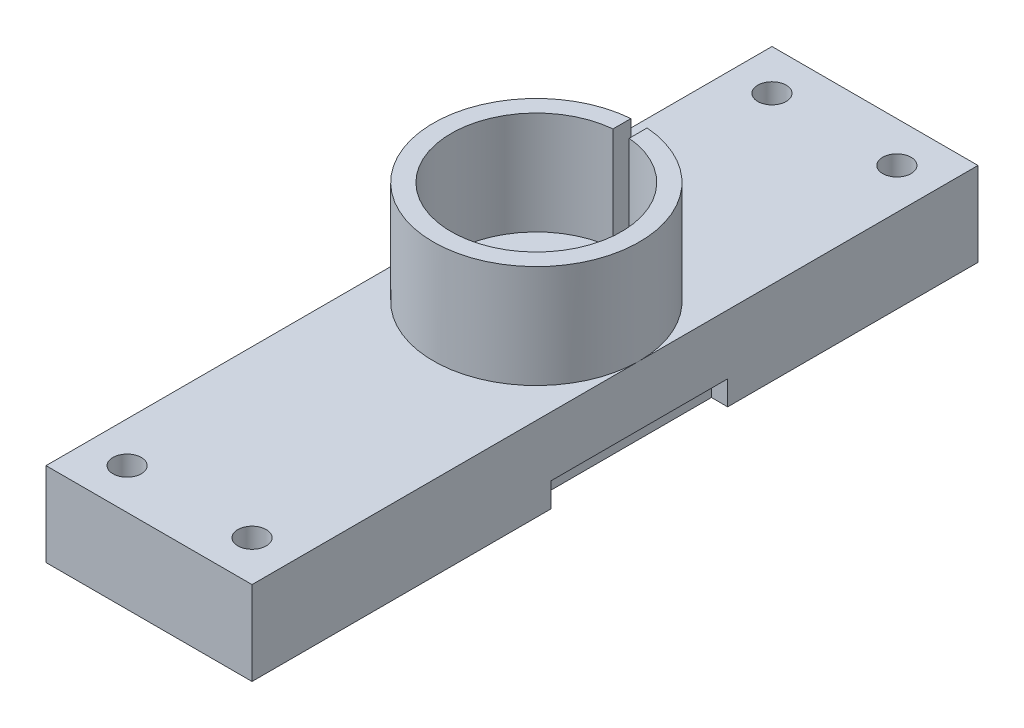
ISO-10303-21;
HEADER;
FILE_DESCRIPTION(('STEP AP214'),'2;1');
FILE_NAME('part.step','',(''),(''),'','','');
FILE_SCHEMA(('AUTOMOTIVE_DESIGN { 1 0 10303 214 1 1 1 1 }'));
ENDSEC;
DATA;
#1=APPLICATION_CONTEXT('core data for automotive mechanical design processes');
#2=APPLICATION_PROTOCOL_DEFINITION('international standard','automotive_design',2000,#1);
#3=PRODUCT_CONTEXT('',#1,'mechanical');
#4=PRODUCT('Part','Part','',(#3));
#5=PRODUCT_RELATED_PRODUCT_CATEGORY('part','',(#4));
#6=PRODUCT_DEFINITION_FORMATION('','',#4);
#7=PRODUCT_DEFINITION_CONTEXT('part definition',#1,'design');
#8=PRODUCT_DEFINITION('design','',#6,#7);
#9=PRODUCT_DEFINITION_SHAPE('','',#8);
#10=(LENGTH_UNIT() NAMED_UNIT(*) SI_UNIT(.MILLI.,.METRE.));
#11=(NAMED_UNIT(*) PLANE_ANGLE_UNIT() SI_UNIT($,.RADIAN.));
#12=(NAMED_UNIT(*) SI_UNIT($,.STERADIAN.) SOLID_ANGLE_UNIT());
#13=UNCERTAINTY_MEASURE_WITH_UNIT(LENGTH_MEASURE(1.E-05),#10,'distance_accuracy_value','');
#14=(GEOMETRIC_REPRESENTATION_CONTEXT(3) GLOBAL_UNCERTAINTY_ASSIGNED_CONTEXT((#13)) GLOBAL_UNIT_ASSIGNED_CONTEXT((#10,
#11,#12)) REPRESENTATION_CONTEXT('',''));
#15=CARTESIAN_POINT('',(0.,0.,0.));
#16=DIRECTION('',(0.,0.,1.));
#17=DIRECTION('',(1.,0.,0.));
#18=AXIS2_PLACEMENT_3D('',#15,#16,#17);
#19=CARTESIAN_POINT('',(0.,0.,0.));
#20=DIRECTION('',(0.,-1.,0.));
#21=DIRECTION('',(0.,0.,-1.));
#22=AXIS2_PLACEMENT_3D('',#19,#20,#21);
#23=PLANE('',#22);
#24=CARTESIAN_POINT('',(12.7,0.,-47.75000007));
#25=DIRECTION('',(0.,-1.,0.));
#26=DIRECTION('',(0.,0.,-1.));
#27=AXIS2_PLACEMENT_3D('',#24,#25,#26);
#28=CIRCLE('',#27,2.);
#29=CARTESIAN_POINT('',(12.7,0.,-49.75000007));
#30=VERTEX_POINT('',#29);
#31=EDGE_CURVE('E230',#30,#30,#28,.F.);
#32=ORIENTED_EDGE('',*,*,#31,.T.);
#33=EDGE_LOOP('',(#32));
#34=FACE_BOUND('',#33,.T.);
#35=CARTESIAN_POINT('',(5.,0.,-5.));
#36=DIRECTION('',(0.,1.,0.));
#37=DIRECTION('',(0.,0.,1.));
#38=AXIS2_PLACEMENT_3D('',#35,#36,#37);
#39=CIRCLE('',#38,1.75);
#40=CARTESIAN_POINT('',(5.,0.,-3.25));
#41=VERTEX_POINT('',#40);
#42=EDGE_CURVE('E273',#41,#41,#39,.T.);
#43=ORIENTED_EDGE('',*,*,#42,.T.);
#44=EDGE_LOOP('',(#43));
#45=FACE_BOUND('',#44,.T.);
#46=CARTESIAN_POINT('',(5.,0.,-84.50000007));
#47=DIRECTION('',(0.,1.,0.));
#48=DIRECTION('',(0.,0.,1.));
#49=AXIS2_PLACEMENT_3D('',#46,#47,#48);
#50=CIRCLE('',#49,1.75);
#51=CARTESIAN_POINT('',(5.,0.,-82.75000007));
#52=VERTEX_POINT('',#51);
#53=EDGE_CURVE('E285',#52,#52,#50,.T.);
#54=ORIENTED_EDGE('',*,*,#53,.T.);
#55=EDGE_LOOP('',(#54));
#56=FACE_BOUND('',#55,.T.);
#57=CARTESIAN_POINT('',(20.4,0.,-84.50000007));
#58=DIRECTION('',(0.,1.,0.));
#59=DIRECTION('',(0.,0.,1.));
#60=AXIS2_PLACEMENT_3D('',#57,#58,#59);
#61=CIRCLE('',#60,1.75);
#62=CARTESIAN_POINT('',(20.4,0.,-82.75000007));
#63=VERTEX_POINT('',#62);
#64=EDGE_CURVE('E279',#63,#63,#61,.T.);
#65=ORIENTED_EDGE('',*,*,#64,.T.);
#66=EDGE_LOOP('',(#65));
#67=FACE_BOUND('',#66,.T.);
#68=CARTESIAN_POINT('',(20.4,0.,-5.));
#69=DIRECTION('',(0.,1.,0.));
#70=DIRECTION('',(0.,0.,1.));
#71=AXIS2_PLACEMENT_3D('',#68,#69,#70);
#72=CIRCLE('',#71,1.75);
#73=CARTESIAN_POINT('',(20.4,0.,-3.25));
#74=VERTEX_POINT('',#73);
#75=EDGE_CURVE('E267',#74,#74,#72,.T.);
#76=ORIENTED_EDGE('',*,*,#75,.T.);
#77=EDGE_LOOP('',(#76));
#78=FACE_BOUND('',#77,.T.);
#79=DIRECTION('',(0.,0.,1.));
#80=VECTOR('',#79,1.);
#81=CARTESIAN_POINT('',(0.,0.,0.));
#82=LINE('',#81,#80);
#83=CARTESIAN_POINT('',(0.,0.,-36.86));
#84=VERTEX_POINT('',#83);
#85=CARTESIAN_POINT('',(0.,0.,0.));
#86=VERTEX_POINT('',#85);
#87=EDGE_CURVE('E291',#84,#86,#82,.T.);
#88=ORIENTED_EDGE('',*,*,#87,.F.);
#89=DIRECTION('',(-1.,0.,0.));
#90=VECTOR('',#89,1.);
#91=CARTESIAN_POINT('',(2.,0.,-36.86));
#92=LINE('',#91,#90);
#93=CARTESIAN_POINT('',(2.,0.,-36.86));
#94=VERTEX_POINT('',#93);
#95=EDGE_CURVE('E194',#94,#84,#92,.T.);
#96=ORIENTED_EDGE('',*,*,#95,.F.);
#97=DIRECTION('',(0.,0.,-1.));
#98=VECTOR('',#97,1.);
#99=CARTESIAN_POINT('',(2.,0.,-36.86));
#100=LINE('',#99,#98);
#101=CARTESIAN_POINT('',(2.,0.,-58.64000007));
#102=VERTEX_POINT('',#101);
#103=EDGE_CURVE('E180',#94,#102,#100,.T.);
#104=ORIENTED_EDGE('',*,*,#103,.T.);
#105=DIRECTION('',(-1.,0.,0.));
#106=VECTOR('',#105,1.);
#107=CARTESIAN_POINT('',(2.,0.,-58.64000007));
#108=LINE('',#107,#106);
#109=CARTESIAN_POINT('',(0.,0.,-58.64000007));
#110=VERTEX_POINT('',#109);
#111=EDGE_CURVE('E197',#102,#110,#108,.T.);
#112=ORIENTED_EDGE('',*,*,#111,.T.);
#113=CARTESIAN_POINT('',(0.,0.,-89.50000007));
#114=VERTEX_POINT('',#113);
#115=EDGE_CURVE('E306',#114,#110,#82,.T.);
#116=ORIENTED_EDGE('',*,*,#115,.F.);
#117=DIRECTION('',(-1.,0.,0.));
#118=VECTOR('',#117,1.);
#119=CARTESIAN_POINT('',(0.,0.,-89.50000007));
#120=LINE('',#119,#118);
#121=CARTESIAN_POINT('',(25.4,0.,-89.50000007));
#122=VERTEX_POINT('',#121);
#123=EDGE_CURVE('E315',#122,#114,#120,.T.);
#124=ORIENTED_EDGE('',*,*,#123,.F.);
#125=DIRECTION('',(0.,0.,-1.));
#126=VECTOR('',#125,1.);
#127=CARTESIAN_POINT('',(25.4,0.,0.));
#128=LINE('',#127,#126);
#129=CARTESIAN_POINT('',(25.4,0.,-58.64000007));
#130=VERTEX_POINT('',#129);
#131=EDGE_CURVE('E311',#130,#122,#128,.T.);
#132=ORIENTED_EDGE('',*,*,#131,.F.);
#133=DIRECTION('',(1.,0.,0.));
#134=VECTOR('',#133,1.);
#135=CARTESIAN_POINT('',(23.4,0.,-58.64000007));
#136=LINE('',#135,#134);
#137=CARTESIAN_POINT('',(23.4,0.,-58.64000007));
#138=VERTEX_POINT('',#137);
#139=EDGE_CURVE('E67',#138,#130,#136,.T.);
#140=ORIENTED_EDGE('',*,*,#139,.F.);
#141=DIRECTION('',(0.,0.,-1.));
#142=VECTOR('',#141,1.);
#143=CARTESIAN_POINT('',(23.4,0.,-36.86));
#144=LINE('',#143,#142);
#145=CARTESIAN_POINT('',(23.4,0.,-36.86));
#146=VERTEX_POINT('',#145);
#147=EDGE_CURVE('E204',#146,#138,#144,.T.);
#148=ORIENTED_EDGE('',*,*,#147,.F.);
#149=DIRECTION('',(1.,0.,0.));
#150=VECTOR('',#149,1.);
#151=CARTESIAN_POINT('',(23.4,0.,-36.86));
#152=LINE('',#151,#150);
#153=CARTESIAN_POINT('',(25.4,0.,-36.86));
#154=VERTEX_POINT('',#153);
#155=EDGE_CURVE('E214',#146,#154,#152,.T.);
#156=ORIENTED_EDGE('',*,*,#155,.T.);
#157=CARTESIAN_POINT('',(25.4,0.,0.));
#158=VERTEX_POINT('',#157);
#159=EDGE_CURVE('E312',#158,#154,#128,.T.);
#160=ORIENTED_EDGE('',*,*,#159,.F.);
#161=DIRECTION('',(1.,0.,0.));
#162=VECTOR('',#161,1.);
#163=CARTESIAN_POINT('',(0.,0.,0.));
#164=LINE('',#163,#162);
#165=EDGE_CURVE('E309',#86,#158,#164,.T.);
#166=ORIENTED_EDGE('',*,*,#165,.F.);
#167=EDGE_LOOP('',(#88,#96,#104,#112,#116,#124,#132,#140,#148,#156,#160,#166));
#168=FACE_BOUND('',#167,.T.);
#169=ADVANCED_FACE('F41',(#34,#45,#56,#67,#78,#168),#23,.T.);
#170=CARTESIAN_POINT('',(0.,10.35,0.));
#171=DIRECTION('',(1.,0.,0.));
#172=DIRECTION('',(0.,0.,-1.));
#173=AXIS2_PLACEMENT_3D('',#170,#171,#172);
#174=PLANE('',#173);
#175=DIRECTION('',(0.,-1.,0.));
#176=VECTOR('',#175,1.);
#177=CARTESIAN_POINT('',(0.,0.,-36.86));
#178=LINE('',#177,#176);
#179=CARTESIAN_POINT('',(0.,3.,-36.86));
#180=VERTEX_POINT('',#179);
#181=EDGE_CURVE('E59',#180,#84,#178,.T.);
#182=ORIENTED_EDGE('',*,*,#181,.T.);
#183=ORIENTED_EDGE('',*,*,#87,.T.);
#184=DIRECTION('',(0.,-1.,0.));
#185=VECTOR('',#184,1.);
#186=CARTESIAN_POINT('',(0.,10.35,0.));
#187=LINE('',#186,#185);
#188=CARTESIAN_POINT('',(0.,10.35,0.));
#189=VERTEX_POINT('',#188);
#190=EDGE_CURVE('E45',#189,#86,#187,.T.);
#191=ORIENTED_EDGE('',*,*,#190,.F.);
#192=DIRECTION('',(0.,0.,1.));
#193=VECTOR('',#192,1.);
#194=CARTESIAN_POINT('',(0.,10.35,0.));
#195=LINE('',#194,#193);
#196=CARTESIAN_POINT('',(0.,10.35,-47.75000007));
#197=VERTEX_POINT('',#196);
#198=EDGE_CURVE('E298',#197,#189,#195,.T.);
#199=ORIENTED_EDGE('',*,*,#198,.F.);
#200=CARTESIAN_POINT('',(0.,10.35,-89.50000007));
#201=VERTEX_POINT('',#200);
#202=EDGE_CURVE('E294',#201,#197,#195,.T.);
#203=ORIENTED_EDGE('',*,*,#202,.F.);
#204=DIRECTION('',(0.,-1.,0.));
#205=VECTOR('',#204,1.);
#206=CARTESIAN_POINT('',(0.,10.35,-89.50000007));
#207=LINE('',#206,#205);
#208=EDGE_CURVE('E305',#201,#114,#207,.T.);
#209=ORIENTED_EDGE('',*,*,#208,.T.);
#210=ORIENTED_EDGE('',*,*,#115,.T.);
#211=DIRECTION('',(0.,1.,0.));
#212=VECTOR('',#211,1.);
#213=CARTESIAN_POINT('',(0.,0.,-58.64000007));
#214=LINE('',#213,#212);
#215=CARTESIAN_POINT('',(0.,3.,-58.64000007));
#216=VERTEX_POINT('',#215);
#217=EDGE_CURVE('E184',#110,#216,#214,.T.);
#218=ORIENTED_EDGE('',*,*,#217,.T.);
#219=DIRECTION('',(0.,0.,1.));
#220=VECTOR('',#219,1.);
#221=CARTESIAN_POINT('',(0.,3.,-36.86));
#222=LINE('',#221,#220);
#223=EDGE_CURVE('E187',#216,#180,#222,.T.);
#224=ORIENTED_EDGE('',*,*,#223,.T.);
#225=EDGE_LOOP('',(#182,#183,#191,#199,#203,#209,#210,#218,#224));
#226=FACE_BOUND('',#225,.T.);
#227=ADVANCED_FACE('F43',(#226),#174,.F.);
#228=CARTESIAN_POINT('',(0.,10.35,0.));
#229=DIRECTION('',(0.,-1.,0.));
#230=DIRECTION('',(0.,0.,-1.));
#231=AXIS2_PLACEMENT_3D('',#228,#229,#230);
#232=PLANE('',#231);
#233=CARTESIAN_POINT('',(12.7,10.35,-47.75000007));
#234=DIRECTION('',(0.,1.,0.));
#235=DIRECTION('',(0.,0.,1.));
#236=AXIS2_PLACEMENT_3D('',#233,#234,#235);
#237=CIRCLE('',#236,12.7);
#238=CARTESIAN_POINT('',(25.4,10.35,-47.75000007));
#239=VERTEX_POINT('',#238);
#240=EDGE_CURVE('E11',#197,#239,#237,.T.);
#241=ORIENTED_EDGE('',*,*,#240,.F.);
#242=ORIENTED_EDGE('',*,*,#198,.T.);
#243=DIRECTION('',(1.,0.,0.));
#244=VECTOR('',#243,1.);
#245=CARTESIAN_POINT('',(0.,10.35,0.));
#246=LINE('',#245,#244);
#247=CARTESIAN_POINT('',(25.4,10.35,0.));
#248=VERTEX_POINT('',#247);
#249=EDGE_CURVE('E297',#189,#248,#246,.T.);
#250=ORIENTED_EDGE('',*,*,#249,.T.);
#251=DIRECTION('',(0.,0.,-1.));
#252=VECTOR('',#251,1.);
#253=CARTESIAN_POINT('',(25.4,10.35,0.));
#254=LINE('',#253,#252);
#255=EDGE_CURVE('E301',#248,#239,#254,.T.);
#256=ORIENTED_EDGE('',*,*,#255,.T.);
#257=EDGE_LOOP('',(#241,#242,#250,#256));
#258=FACE_BOUND('',#257,.T.);
#259=CARTESIAN_POINT('',(5.,10.35,-5.));
#260=DIRECTION('',(0.,1.,0.));
#261=DIRECTION('',(0.,0.,1.));
#262=AXIS2_PLACEMENT_3D('',#259,#260,#261);
#263=CIRCLE('',#262,1.75);
#264=CARTESIAN_POINT('',(5.,10.35,-3.25));
#265=VERTEX_POINT('',#264);
#266=EDGE_CURVE('E276',#265,#265,#263,.T.);
#267=ORIENTED_EDGE('',*,*,#266,.F.);
#268=EDGE_LOOP('',(#267));
#269=FACE_BOUND('',#268,.T.);
#270=CARTESIAN_POINT('',(20.4,10.35,-5.));
#271=DIRECTION('',(0.,1.,0.));
#272=DIRECTION('',(0.,0.,1.));
#273=AXIS2_PLACEMENT_3D('',#270,#271,#272);
#274=CIRCLE('',#273,1.75);
#275=CARTESIAN_POINT('',(20.4,10.35,-3.25));
#276=VERTEX_POINT('',#275);
#277=EDGE_CURVE('E270',#276,#276,#274,.T.);
#278=ORIENTED_EDGE('',*,*,#277,.F.);
#279=EDGE_LOOP('',(#278));
#280=FACE_BOUND('',#279,.T.);
#281=ADVANCED_FACE('F365',(#258,#269,#280),#232,.F.);
#282=CARTESIAN_POINT('',(0.,10.35,0.));
#283=DIRECTION('',(0.,0.,-1.));
#284=DIRECTION('',(-1.,0.,0.));
#285=AXIS2_PLACEMENT_3D('',#282,#283,#284);
#286=PLANE('',#285);
#287=ORIENTED_EDGE('',*,*,#165,.T.);
#288=DIRECTION('',(0.,-1.,0.));
#289=VECTOR('',#288,1.);
#290=CARTESIAN_POINT('',(25.4,10.35,0.));
#291=LINE('',#290,#289);
#292=EDGE_CURVE('E321',#248,#158,#291,.T.);
#293=ORIENTED_EDGE('',*,*,#292,.F.);
#294=ORIENTED_EDGE('',*,*,#249,.F.);
#295=ORIENTED_EDGE('',*,*,#190,.T.);
#296=EDGE_LOOP('',(#287,#293,#294,#295));
#297=FACE_BOUND('',#296,.T.);
#298=ADVANCED_FACE('F331',(#297),#286,.F.);
#299=CARTESIAN_POINT('',(25.4,10.35,0.));
#300=DIRECTION('',(-1.,0.,0.));
#301=DIRECTION('',(0.,0.,1.));
#302=AXIS2_PLACEMENT_3D('',#299,#300,#301);
#303=PLANE('',#302);
#304=ORIENTED_EDGE('',*,*,#159,.T.);
#305=DIRECTION('',(0.,-1.,0.));
#306=VECTOR('',#305,1.);
#307=CARTESIAN_POINT('',(25.4,0.,-36.86));
#308=LINE('',#307,#306);
#309=CARTESIAN_POINT('',(25.4,3.,-36.86));
#310=VERTEX_POINT('',#309);
#311=EDGE_CURVE('E196',#310,#154,#308,.T.);
#312=ORIENTED_EDGE('',*,*,#311,.F.);
#313=DIRECTION('',(0.,0.,1.));
#314=VECTOR('',#313,1.);
#315=CARTESIAN_POINT('',(25.4,3.,-36.86));
#316=LINE('',#315,#314);
#317=CARTESIAN_POINT('',(25.4,3.,-58.64000007));
#318=VERTEX_POINT('',#317);
#319=EDGE_CURVE('E205',#318,#310,#316,.T.);
#320=ORIENTED_EDGE('',*,*,#319,.F.);
#321=DIRECTION('',(0.,1.,0.));
#322=VECTOR('',#321,1.);
#323=CARTESIAN_POINT('',(25.4,0.,-58.64000007));
#324=LINE('',#323,#322);
#325=EDGE_CURVE('E216',#130,#318,#324,.T.);
#326=ORIENTED_EDGE('',*,*,#325,.F.);
#327=ORIENTED_EDGE('',*,*,#131,.T.);
#328=DIRECTION('',(0.,-1.,0.));
#329=VECTOR('',#328,1.);
#330=CARTESIAN_POINT('',(25.4,10.35,-89.50000007));
#331=LINE('',#330,#329);
#332=CARTESIAN_POINT('',(25.4,10.35,-89.50000007));
#333=VERTEX_POINT('',#332);
#334=EDGE_CURVE('E319',#333,#122,#331,.T.);
#335=ORIENTED_EDGE('',*,*,#334,.F.);
#336=EDGE_CURVE('E300',#239,#333,#254,.T.);
#337=ORIENTED_EDGE('',*,*,#336,.F.);
#338=ORIENTED_EDGE('',*,*,#255,.F.);
#339=ORIENTED_EDGE('',*,*,#292,.T.);
#340=EDGE_LOOP('',(#304,#312,#320,#326,#327,#335,#337,#338,#339));
#341=FACE_BOUND('',#340,.T.);
#342=ADVANCED_FACE('F340',(#341),#303,.F.);
#343=CARTESIAN_POINT('',(0.,10.35,-89.50000007));
#344=DIRECTION('',(0.,0.,1.));
#345=DIRECTION('',(1.,0.,0.));
#346=AXIS2_PLACEMENT_3D('',#343,#344,#345);
#347=PLANE('',#346);
#348=ORIENTED_EDGE('',*,*,#123,.T.);
#349=ORIENTED_EDGE('',*,*,#208,.F.);
#350=DIRECTION('',(-1.,0.,0.));
#351=VECTOR('',#350,1.);
#352=CARTESIAN_POINT('',(0.,10.35,-89.50000007));
#353=LINE('',#352,#351);
#354=EDGE_CURVE('E303',#333,#201,#353,.T.);
#355=ORIENTED_EDGE('',*,*,#354,.F.);
#356=ORIENTED_EDGE('',*,*,#334,.T.);
#357=EDGE_LOOP('',(#348,#349,#355,#356));
#358=FACE_BOUND('',#357,.T.);
#359=ADVANCED_FACE('F355',(#358),#347,.F.);
#360=CARTESIAN_POINT('',(5.,10.35,-84.50000007));
#361=DIRECTION('',(0.,-1.,0.));
#362=DIRECTION('',(0.,0.,-1.));
#363=AXIS2_PLACEMENT_3D('',#360,#361,#362);
#364=CYLINDRICAL_SURFACE('',#363,1.75);
#365=CARTESIAN_POINT('',(5.,10.35,-84.50000007));
#366=DIRECTION('',(0.,1.,0.));
#367=DIRECTION('',(0.,0.,1.));
#368=AXIS2_PLACEMENT_3D('',#365,#366,#367);
#369=CIRCLE('',#368,1.75);
#370=CARTESIAN_POINT('',(5.,10.35,-82.75000007));
#371=VERTEX_POINT('',#370);
#372=EDGE_CURVE('E288',#371,#371,#369,.T.);
#373=ORIENTED_EDGE('',*,*,#372,.T.);
#374=EDGE_LOOP('',(#373));
#375=FACE_BOUND('',#374,.T.);
#376=ORIENTED_EDGE('',*,*,#53,.F.);
#377=EDGE_LOOP('',(#376));
#378=FACE_BOUND('',#377,.T.);
#379=ADVANCED_FACE('F406',(#375,#378),#364,.F.);
#380=CARTESIAN_POINT('',(20.4,10.35,-84.50000007));
#381=DIRECTION('',(0.,-1.,0.));
#382=DIRECTION('',(0.,0.,-1.));
#383=AXIS2_PLACEMENT_3D('',#380,#381,#382);
#384=CYLINDRICAL_SURFACE('',#383,1.75);
#385=CARTESIAN_POINT('',(20.4,10.35,-84.50000007));
#386=DIRECTION('',(0.,1.,0.));
#387=DIRECTION('',(0.,0.,1.));
#388=AXIS2_PLACEMENT_3D('',#385,#386,#387);
#389=CIRCLE('',#388,1.75);
#390=CARTESIAN_POINT('',(20.4,10.35,-82.75000007));
#391=VERTEX_POINT('',#390);
#392=EDGE_CURVE('E282',#391,#391,#389,.T.);
#393=ORIENTED_EDGE('',*,*,#392,.T.);
#394=EDGE_LOOP('',(#393));
#395=FACE_BOUND('',#394,.T.);
#396=ORIENTED_EDGE('',*,*,#64,.F.);
#397=EDGE_LOOP('',(#396));
#398=FACE_BOUND('',#397,.T.);
#399=ADVANCED_FACE('F611',(#395,#398),#384,.F.);
#400=CARTESIAN_POINT('',(5.,10.35,-5.));
#401=DIRECTION('',(0.,-1.,0.));
#402=DIRECTION('',(0.,0.,-1.));
#403=AXIS2_PLACEMENT_3D('',#400,#401,#402);
#404=CYLINDRICAL_SURFACE('',#403,1.75);
#405=ORIENTED_EDGE('',*,*,#266,.T.);
#406=EDGE_LOOP('',(#405));
#407=FACE_BOUND('',#406,.T.);
#408=ORIENTED_EDGE('',*,*,#42,.F.);
#409=EDGE_LOOP('',(#408));
#410=FACE_BOUND('',#409,.T.);
#411=ADVANCED_FACE('F600',(#407,#410),#404,.F.);
#412=CARTESIAN_POINT('',(20.4,10.35,-5.));
#413=DIRECTION('',(0.,-1.,0.));
#414=DIRECTION('',(0.,0.,-1.));
#415=AXIS2_PLACEMENT_3D('',#412,#413,#414);
#416=CYLINDRICAL_SURFACE('',#415,1.75);
#417=ORIENTED_EDGE('',*,*,#277,.T.);
#418=EDGE_LOOP('',(#417));
#419=FACE_BOUND('',#418,.T.);
#420=ORIENTED_EDGE('',*,*,#75,.F.);
#421=EDGE_LOOP('',(#420));
#422=FACE_BOUND('',#421,.T.);
#423=ADVANCED_FACE('F589',(#419,#422),#416,.F.);
#424=CARTESIAN_POINT('',(12.7,23.05,-47.75000007));
#425=DIRECTION('',(0.,1.,0.));
#426=DIRECTION('',(0.,0.,1.));
#427=AXIS2_PLACEMENT_3D('',#424,#425,#426);
#428=PLANE('',#427);
#429=DIRECTION('',(0.,0.,-1.));
#430=VECTOR('',#429,1.);
#431=CARTESIAN_POINT('',(13.7,23.05,-62.7042575224812));
#432=LINE('',#431,#430);
#433=CARTESIAN_POINT('',(13.7,23.05,-58.2022725501834));
#434=VERTEX_POINT('',#433);
#435=CARTESIAN_POINT('',(13.7,23.05,-60.4105687776055));
#436=VERTEX_POINT('',#435);
#437=EDGE_CURVE('E240',#434,#436,#432,.T.);
#438=ORIENTED_EDGE('',*,*,#437,.F.);
#439=CARTESIAN_POINT('',(12.7,23.05,-47.75000007));
#440=DIRECTION('',(0.,1.,0.));
#441=DIRECTION('',(0.,0.,1.));
#442=AXIS2_PLACEMENT_3D('',#439,#440,#441);
#443=CIRCLE('',#442,10.5);
#444=CARTESIAN_POINT('',(11.7,23.05,-58.2022725501834));
#445=VERTEX_POINT('',#444);
#446=EDGE_CURVE('E260',#445,#434,#443,.T.);
#447=ORIENTED_EDGE('',*,*,#446,.F.);
#448=DIRECTION('',(0.,0.,1.));
#449=VECTOR('',#448,1.);
#450=CARTESIAN_POINT('',(11.7,23.05,-62.7042575224812));
#451=LINE('',#450,#449);
#452=CARTESIAN_POINT('',(11.7,23.05,-60.4105687776055));
#453=VERTEX_POINT('',#452);
#454=EDGE_CURVE('E237',#453,#445,#451,.T.);
#455=ORIENTED_EDGE('',*,*,#454,.F.);
#456=CARTESIAN_POINT('',(12.7,23.05,-47.75000007));
#457=DIRECTION('',(0.,1.,0.));
#458=DIRECTION('',(0.,0.,1.));
#459=AXIS2_PLACEMENT_3D('',#456,#457,#458);
#460=CIRCLE('',#459,12.7);
#461=EDGE_CURVE('E265',#453,#436,#460,.T.);
#462=ORIENTED_EDGE('',*,*,#461,.T.);
#463=EDGE_LOOP('',(#438,#447,#455,#462));
#464=FACE_BOUND('',#463,.T.);
#465=ADVANCED_FACE('F377',(#464),#428,.T.);
#466=CARTESIAN_POINT('',(12.7,23.05,-47.75000007));
#467=DIRECTION('',(0.,-1.,0.));
#468=DIRECTION('',(0.,0.,-1.));
#469=AXIS2_PLACEMENT_3D('',#466,#467,#468);
#470=CYLINDRICAL_SURFACE('',#469,12.7);
#471=CARTESIAN_POINT('',(13.7,10.35,-60.4105687776055));
#472=VERTEX_POINT('',#471);
#473=EDGE_CURVE('E51',#239,#472,#237,.T.);
#474=ORIENTED_EDGE('',*,*,#473,.T.);
#475=DIRECTION('',(0.,-1.,0.));
#476=VECTOR('',#475,1.);
#477=CARTESIAN_POINT('',(13.7,23.05,-60.4105687776055));
#478=LINE('',#477,#476);
#479=EDGE_CURVE('E256',#472,#436,#478,.F.);
#480=ORIENTED_EDGE('',*,*,#479,.T.);
#481=ORIENTED_EDGE('',*,*,#461,.F.);
#482=DIRECTION('',(0.,-1.,0.));
#483=VECTOR('',#482,1.);
#484=CARTESIAN_POINT('',(11.7,23.05,-60.4105687776055));
#485=LINE('',#484,#483);
#486=CARTESIAN_POINT('',(11.7,10.35,-60.4105687776055));
#487=VERTEX_POINT('',#486);
#488=EDGE_CURVE('E251',#453,#487,#485,.T.);
#489=ORIENTED_EDGE('',*,*,#488,.T.);
#490=EDGE_CURVE('E52',#487,#197,#237,.T.);
#491=ORIENTED_EDGE('',*,*,#490,.T.);
#492=ORIENTED_EDGE('',*,*,#240,.T.);
#493=EDGE_LOOP('',(#474,#480,#481,#489,#491,#492));
#494=FACE_BOUND('',#493,.T.);
#495=ADVANCED_FACE('F368',(#494),#470,.T.);
#496=CARTESIAN_POINT('',(12.7,23.05,-47.75000007));
#497=DIRECTION('',(0.,-1.,0.));
#498=DIRECTION('',(0.,0.,-1.));
#499=AXIS2_PLACEMENT_3D('',#496,#497,#498);
#500=CYLINDRICAL_SURFACE('',#499,10.5);
#501=DIRECTION('',(0.,-1.,0.));
#502=VECTOR('',#501,1.);
#503=CARTESIAN_POINT('',(13.7,23.05,-58.2022725501834));
#504=LINE('',#503,#502);
#505=CARTESIAN_POINT('',(13.7,10.35,-58.2022725501834));
#506=VERTEX_POINT('',#505);
#507=EDGE_CURVE('E254',#506,#434,#504,.F.);
#508=ORIENTED_EDGE('',*,*,#507,.F.);
#509=CARTESIAN_POINT('',(12.7,10.35,-47.75000007));
#510=DIRECTION('',(0.,1.,0.));
#511=DIRECTION('',(0.,0.,1.));
#512=AXIS2_PLACEMENT_3D('',#509,#510,#511);
#513=CIRCLE('',#512,10.5);
#514=CARTESIAN_POINT('',(11.7,10.35,-58.2022725501834));
#515=VERTEX_POINT('',#514);
#516=EDGE_CURVE('E259',#515,#506,#513,.T.);
#517=ORIENTED_EDGE('',*,*,#516,.F.);
#518=DIRECTION('',(0.,-1.,0.));
#519=VECTOR('',#518,1.);
#520=CARTESIAN_POINT('',(11.7,23.05,-58.2022725501834));
#521=LINE('',#520,#519);
#522=EDGE_CURVE('E247',#445,#515,#521,.T.);
#523=ORIENTED_EDGE('',*,*,#522,.F.);
#524=ORIENTED_EDGE('',*,*,#446,.T.);
#525=EDGE_LOOP('',(#508,#517,#523,#524));
#526=FACE_BOUND('',#525,.T.);
#527=ADVANCED_FACE('F380',(#526),#500,.F.);
#528=CARTESIAN_POINT('',(12.7,10.35,-47.75000007));
#529=DIRECTION('',(0.,1.,0.));
#530=DIRECTION('',(0.,0.,1.));
#531=AXIS2_PLACEMENT_3D('',#528,#529,#530);
#532=CIRCLE('',#531,6.);
#533=CARTESIAN_POINT('',(12.7,10.35,-41.75000007));
#534=VERTEX_POINT('',#533);
#535=EDGE_CURVE('E233',#534,#534,#532,.T.);
#536=ORIENTED_EDGE('',*,*,#535,.F.);
#537=EDGE_LOOP('',(#536));
#538=FACE_BOUND('',#537,.T.);
#539=DIRECTION('',(0.,0.,-1.));
#540=VECTOR('',#539,1.);
#541=CARTESIAN_POINT('',(13.7,10.35,-62.7042575224812));
#542=LINE('',#541,#540);
#543=EDGE_CURVE('E242',#506,#472,#542,.T.);
#544=ORIENTED_EDGE('',*,*,#543,.T.);
#545=ORIENTED_EDGE('',*,*,#473,.F.);
#546=ORIENTED_EDGE('',*,*,#336,.T.);
#547=ORIENTED_EDGE('',*,*,#354,.T.);
#548=ORIENTED_EDGE('',*,*,#202,.T.);
#549=ORIENTED_EDGE('',*,*,#490,.F.);
#550=DIRECTION('',(0.,0.,1.));
#551=VECTOR('',#550,1.);
#552=CARTESIAN_POINT('',(11.7,10.35,-62.7042575224812));
#553=LINE('',#552,#551);
#554=EDGE_CURVE('E244',#487,#515,#553,.T.);
#555=ORIENTED_EDGE('',*,*,#554,.T.);
#556=ORIENTED_EDGE('',*,*,#516,.T.);
#557=EDGE_LOOP('',(#544,#545,#546,#547,#548,#549,#555,#556));
#558=FACE_BOUND('',#557,.T.);
#559=ORIENTED_EDGE('',*,*,#392,.F.);
#560=EDGE_LOOP('',(#559));
#561=FACE_BOUND('',#560,.T.);
#562=ORIENTED_EDGE('',*,*,#372,.F.);
#563=EDGE_LOOP('',(#562));
#564=FACE_BOUND('',#563,.T.);
#565=ADVANCED_FACE('F359',(#538,#558,#561,#564),#232,.F.);
#566=CARTESIAN_POINT('',(13.7,2.09653797374914,-62.7042575224812));
#567=DIRECTION('',(1.,0.,0.));
#568=DIRECTION('',(0.,0.,-1.));
#569=AXIS2_PLACEMENT_3D('',#566,#567,#568);
#570=PLANE('',#569);
#571=ORIENTED_EDGE('',*,*,#543,.F.);
#572=ORIENTED_EDGE('',*,*,#507,.T.);
#573=ORIENTED_EDGE('',*,*,#437,.T.);
#574=ORIENTED_EDGE('',*,*,#479,.F.);
#575=EDGE_LOOP('',(#571,#572,#573,#574));
#576=FACE_BOUND('',#575,.T.);
#577=ADVANCED_FACE('F383',(#576),#570,.F.);
#578=CARTESIAN_POINT('',(11.7,2.09653797374914,-62.7042575224812));
#579=DIRECTION('',(-1.,0.,0.));
#580=DIRECTION('',(0.,0.,1.));
#581=AXIS2_PLACEMENT_3D('',#578,#579,#580);
#582=PLANE('',#581);
#583=ORIENTED_EDGE('',*,*,#454,.T.);
#584=ORIENTED_EDGE('',*,*,#522,.T.);
#585=ORIENTED_EDGE('',*,*,#554,.F.);
#586=ORIENTED_EDGE('',*,*,#488,.F.);
#587=EDGE_LOOP('',(#583,#584,#585,#586));
#588=FACE_BOUND('',#587,.T.);
#589=ADVANCED_FACE('F372',(#588),#582,.F.);
#590=CARTESIAN_POINT('',(12.7,7.35,-47.75000007));
#591=DIRECTION('',(0.,1.,0.));
#592=DIRECTION('',(0.,0.,1.));
#593=AXIS2_PLACEMENT_3D('',#590,#591,#592);
#594=CYLINDRICAL_SURFACE('',#593,6.);
#595=CARTESIAN_POINT('',(12.7,7.35,-47.75000007));
#596=DIRECTION('',(0.,1.,0.));
#597=DIRECTION('',(0.,0.,1.));
#598=AXIS2_PLACEMENT_3D('',#595,#596,#597);
#599=CIRCLE('',#598,6.);
#600=CARTESIAN_POINT('',(12.7,7.35,-41.75000007));
#601=VERTEX_POINT('',#600);
#602=EDGE_CURVE('E234',#601,#601,#599,.T.);
#603=ORIENTED_EDGE('',*,*,#602,.F.);
#604=EDGE_LOOP('',(#603));
#605=FACE_BOUND('',#604,.T.);
#606=ORIENTED_EDGE('',*,*,#535,.T.);
#607=EDGE_LOOP('',(#606));
#608=FACE_BOUND('',#607,.T.);
#609=ADVANCED_FACE('F390',(#605,#608),#594,.F.);
#610=CARTESIAN_POINT('',(12.7,7.35,-47.75000007));
#611=DIRECTION('',(0.,1.,0.));
#612=DIRECTION('',(0.,0.,1.));
#613=AXIS2_PLACEMENT_3D('',#610,#611,#612);
#614=PLANE('',#613);
#615=CARTESIAN_POINT('',(12.7,7.35,-47.75000007));
#616=DIRECTION('',(0.,1.,0.));
#617=DIRECTION('',(0.,0.,1.));
#618=AXIS2_PLACEMENT_3D('',#615,#616,#617);
#619=CIRCLE('',#618,2.);
#620=CARTESIAN_POINT('',(12.7,7.35,-45.75000007));
#621=VERTEX_POINT('',#620);
#622=EDGE_CURVE('E222',#621,#621,#619,.T.);
#623=ORIENTED_EDGE('',*,*,#622,.F.);
#624=EDGE_LOOP('',(#623));
#625=FACE_BOUND('',#624,.T.);
#626=ORIENTED_EDGE('',*,*,#602,.T.);
#627=EDGE_LOOP('',(#626));
#628=FACE_BOUND('',#627,.T.);
#629=ADVANCED_FACE('F521',(#625,#628),#614,.T.);
#630=CARTESIAN_POINT('',(12.7,-5.65685424949238,-47.75000007));
#631=DIRECTION('',(0.,1.,0.));
#632=DIRECTION('',(0.,0.,1.));
#633=AXIS2_PLACEMENT_3D('',#630,#631,#632);
#634=CYLINDRICAL_SURFACE('',#633,2.);
#635=ORIENTED_EDGE('',*,*,#622,.T.);
#636=EDGE_LOOP('',(#635));
#637=FACE_BOUND('',#636,.T.);
#638=ORIENTED_EDGE('',*,*,#31,.F.);
#639=EDGE_LOOP('',(#638));
#640=FACE_BOUND('',#639,.T.);
#641=ADVANCED_FACE('F510',(#637,#640),#634,.F.);
#642=CARTESIAN_POINT('',(23.4,0.,-36.86));
#643=DIRECTION('',(0.,0.,1.));
#644=DIRECTION('',(1.,0.,0.));
#645=AXIS2_PLACEMENT_3D('',#642,#643,#644);
#646=PLANE('',#645);
#647=ORIENTED_EDGE('',*,*,#311,.T.);
#648=ORIENTED_EDGE('',*,*,#155,.F.);
#649=DIRECTION('',(0.,-1.,0.));
#650=VECTOR('',#649,1.);
#651=CARTESIAN_POINT('',(23.4,0.,-36.86));
#652=LINE('',#651,#650);
#653=CARTESIAN_POINT('',(23.4,3.,-36.86));
#654=VERTEX_POINT('',#653);
#655=EDGE_CURVE('E201',#654,#146,#652,.T.);
#656=ORIENTED_EDGE('',*,*,#655,.F.);
#657=DIRECTION('',(1.,0.,0.));
#658=VECTOR('',#657,1.);
#659=CARTESIAN_POINT('',(23.4,3.,-36.86));
#660=LINE('',#659,#658);
#661=EDGE_CURVE('E220',#654,#310,#660,.T.);
#662=ORIENTED_EDGE('',*,*,#661,.T.);
#663=EDGE_LOOP('',(#647,#648,#656,#662));
#664=FACE_BOUND('',#663,.T.);
#665=ADVANCED_FACE('F343',(#664),#646,.F.);
#666=CARTESIAN_POINT('',(23.4,3.,-36.86));
#667=DIRECTION('',(0.,1.,0.));
#668=DIRECTION('',(0.,0.,1.));
#669=AXIS2_PLACEMENT_3D('',#666,#667,#668);
#670=PLANE('',#669);
#671=ORIENTED_EDGE('',*,*,#319,.T.);
#672=ORIENTED_EDGE('',*,*,#661,.F.);
#673=DIRECTION('',(0.,0.,1.));
#674=VECTOR('',#673,1.);
#675=CARTESIAN_POINT('',(23.4,3.,-36.86));
#676=LINE('',#675,#674);
#677=CARTESIAN_POINT('',(23.4,3.,-58.64000007));
#678=VERTEX_POINT('',#677);
#679=EDGE_CURVE('E211',#678,#654,#676,.T.);
#680=ORIENTED_EDGE('',*,*,#679,.F.);
#681=DIRECTION('',(1.,0.,0.));
#682=VECTOR('',#681,1.);
#683=CARTESIAN_POINT('',(23.4,3.,-58.64000007));
#684=LINE('',#683,#682);
#685=EDGE_CURVE('E223',#678,#318,#684,.T.);
#686=ORIENTED_EDGE('',*,*,#685,.T.);
#687=EDGE_LOOP('',(#671,#672,#680,#686));
#688=FACE_BOUND('',#687,.T.);
#689=ADVANCED_FACE('F347',(#688),#670,.F.);
#690=CARTESIAN_POINT('',(23.4,0.,-58.64000007));
#691=DIRECTION('',(0.,0.,-1.));
#692=DIRECTION('',(-1.,0.,0.));
#693=AXIS2_PLACEMENT_3D('',#690,#691,#692);
#694=PLANE('',#693);
#695=ORIENTED_EDGE('',*,*,#325,.T.);
#696=ORIENTED_EDGE('',*,*,#685,.F.);
#697=DIRECTION('',(0.,1.,0.));
#698=VECTOR('',#697,1.);
#699=CARTESIAN_POINT('',(23.4,0.,-58.64000007));
#700=LINE('',#699,#698);
#701=EDGE_CURVE('E208',#138,#678,#700,.T.);
#702=ORIENTED_EDGE('',*,*,#701,.F.);
#703=ORIENTED_EDGE('',*,*,#139,.T.);
#704=EDGE_LOOP('',(#695,#696,#702,#703));
#705=FACE_BOUND('',#704,.T.);
#706=ADVANCED_FACE('F348',(#705),#694,.F.);
#707=CARTESIAN_POINT('',(23.4,0.,0.));
#708=DIRECTION('',(-1.,0.,0.));
#709=DIRECTION('',(0.,0.,1.));
#710=AXIS2_PLACEMENT_3D('',#707,#708,#709);
#711=PLANE('',#710);
#712=ORIENTED_EDGE('',*,*,#655,.T.);
#713=ORIENTED_EDGE('',*,*,#147,.T.);
#714=ORIENTED_EDGE('',*,*,#701,.T.);
#715=ORIENTED_EDGE('',*,*,#679,.T.);
#716=EDGE_LOOP('',(#712,#713,#714,#715));
#717=FACE_BOUND('',#716,.T.);
#718=ADVANCED_FACE('F434',(#717),#711,.F.);
#719=CARTESIAN_POINT('',(2.,0.,-36.86));
#720=DIRECTION('',(0.,0.,-1.));
#721=DIRECTION('',(-1.,0.,0.));
#722=AXIS2_PLACEMENT_3D('',#719,#720,#721);
#723=PLANE('',#722);
#724=ORIENTED_EDGE('',*,*,#181,.F.);
#725=DIRECTION('',(-1.,0.,0.));
#726=VECTOR('',#725,1.);
#727=CARTESIAN_POINT('',(2.,3.,-36.86));
#728=LINE('',#727,#726);
#729=CARTESIAN_POINT('',(2.,3.,-36.86));
#730=VERTEX_POINT('',#729);
#731=EDGE_CURVE('E168',#730,#180,#728,.T.);
#732=ORIENTED_EDGE('',*,*,#731,.F.);
#733=DIRECTION('',(0.,-1.,0.));
#734=VECTOR('',#733,1.);
#735=CARTESIAN_POINT('',(2.,0.,-36.86));
#736=LINE('',#735,#734);
#737=EDGE_CURVE('E175',#730,#94,#736,.T.);
#738=ORIENTED_EDGE('',*,*,#737,.T.);
#739=ORIENTED_EDGE('',*,*,#95,.T.);
#740=EDGE_LOOP('',(#724,#732,#738,#739));
#741=FACE_BOUND('',#740,.T.);
#742=ADVANCED_FACE('F178',(#741),#723,.T.);
#743=CARTESIAN_POINT('',(2.,0.,-58.64000007));
#744=DIRECTION('',(0.,0.,1.));
#745=DIRECTION('',(1.,0.,0.));
#746=AXIS2_PLACEMENT_3D('',#743,#744,#745);
#747=PLANE('',#746);
#748=ORIENTED_EDGE('',*,*,#217,.F.);
#749=ORIENTED_EDGE('',*,*,#111,.F.);
#750=DIRECTION('',(0.,1.,0.));
#751=VECTOR('',#750,1.);
#752=CARTESIAN_POINT('',(2.,0.,-58.64000007));
#753=LINE('',#752,#751);
#754=CARTESIAN_POINT('',(2.,3.,-58.64000007));
#755=VERTEX_POINT('',#754);
#756=EDGE_CURVE('E174',#102,#755,#753,.T.);
#757=ORIENTED_EDGE('',*,*,#756,.T.);
#758=DIRECTION('',(-1.,0.,0.));
#759=VECTOR('',#758,1.);
#760=CARTESIAN_POINT('',(2.,3.,-58.64000007));
#761=LINE('',#760,#759);
#762=EDGE_CURVE('E170',#755,#216,#761,.T.);
#763=ORIENTED_EDGE('',*,*,#762,.T.);
#764=EDGE_LOOP('',(#748,#749,#757,#763));
#765=FACE_BOUND('',#764,.T.);
#766=ADVANCED_FACE('F433',(#765),#747,.T.);
#767=CARTESIAN_POINT('',(2.,3.,-36.86));
#768=DIRECTION('',(0.,-1.,0.));
#769=DIRECTION('',(0.,0.,-1.));
#770=AXIS2_PLACEMENT_3D('',#767,#768,#769);
#771=PLANE('',#770);
#772=ORIENTED_EDGE('',*,*,#223,.F.);
#773=ORIENTED_EDGE('',*,*,#762,.F.);
#774=DIRECTION('',(0.,0.,1.));
#775=VECTOR('',#774,1.);
#776=CARTESIAN_POINT('',(2.,3.,-36.86));
#777=LINE('',#776,#775);
#778=EDGE_CURVE('E165',#755,#730,#777,.T.);
#779=ORIENTED_EDGE('',*,*,#778,.T.);
#780=ORIENTED_EDGE('',*,*,#731,.T.);
#781=EDGE_LOOP('',(#772,#773,#779,#780));
#782=FACE_BOUND('',#781,.T.);
#783=ADVANCED_FACE('F167',(#782),#771,.T.);
#784=CARTESIAN_POINT('',(2.,0.,0.));
#785=DIRECTION('',(1.,0.,0.));
#786=DIRECTION('',(0.,0.,1.));
#787=AXIS2_PLACEMENT_3D('',#784,#785,#786);
#788=PLANE('',#787);
#789=ORIENTED_EDGE('',*,*,#737,.F.);
#790=ORIENTED_EDGE('',*,*,#778,.F.);
#791=ORIENTED_EDGE('',*,*,#756,.F.);
#792=ORIENTED_EDGE('',*,*,#103,.F.);
#793=EDGE_LOOP('',(#789,#790,#791,#792));
#794=FACE_BOUND('',#793,.T.);
#795=ADVANCED_FACE('F182',(#794),#788,.F.);
#796=CLOSED_SHELL('',(#169,#227,#281,#298,#342,#359,#379,#399,#411,#423,#465,#495,#527,#565,
#577,#589,#609,#629,#641,#665,#689,#706,#718,#742,#766,#783,#795));
#797=MANIFOLD_SOLID_BREP('B2',#796);
#798=ADVANCED_BREP_SHAPE_REPRESENTATION('',(#18,#797),#14);
#799=SHAPE_DEFINITION_REPRESENTATION(#9,#798);
ENDSEC;
END-ISO-10303-21;
